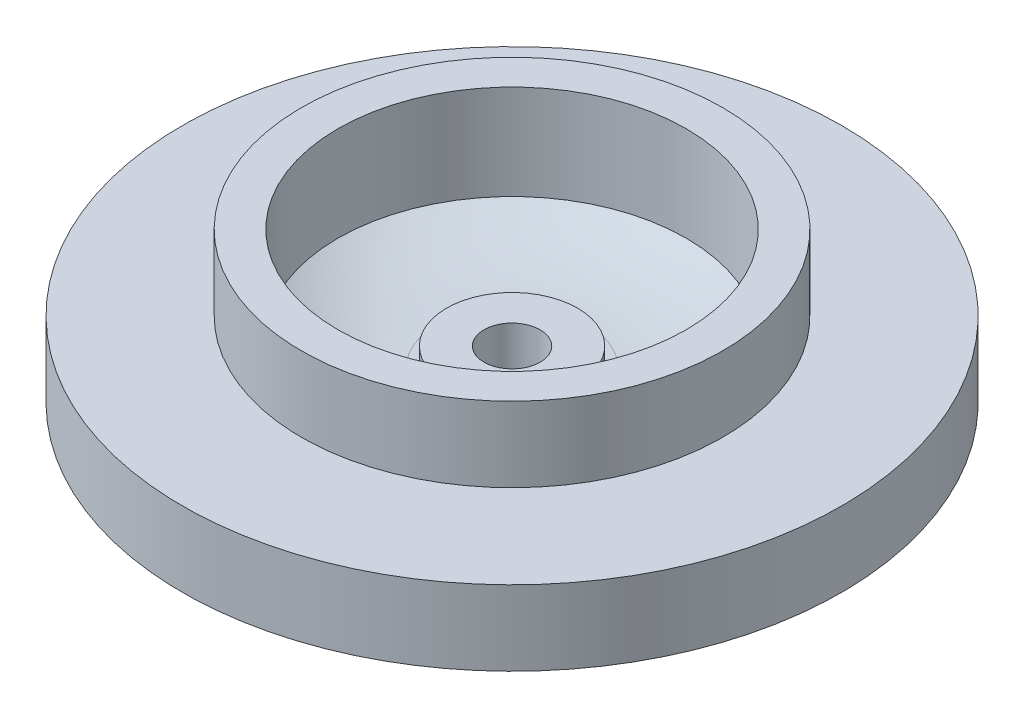
ISO-10303-21;
HEADER;
FILE_DESCRIPTION(('STEP AP214'),'2;1');
FILE_NAME('part.step','',(''),(''),'','','');
FILE_SCHEMA(('AUTOMOTIVE_DESIGN { 1 0 10303 214 1 1 1 1 }'));
ENDSEC;
DATA;
#1=APPLICATION_CONTEXT('core data for automotive mechanical design processes');
#2=APPLICATION_PROTOCOL_DEFINITION('international standard','automotive_design',2000,#1);
#3=PRODUCT_CONTEXT('',#1,'mechanical');
#4=PRODUCT('Part','Part','',(#3));
#5=PRODUCT_RELATED_PRODUCT_CATEGORY('part','',(#4));
#6=PRODUCT_DEFINITION_FORMATION('','',#4);
#7=PRODUCT_DEFINITION_CONTEXT('part definition',#1,'design');
#8=PRODUCT_DEFINITION('design','',#6,#7);
#9=PRODUCT_DEFINITION_SHAPE('','',#8);
#10=(LENGTH_UNIT() NAMED_UNIT(*) SI_UNIT(.MILLI.,.METRE.));
#11=(NAMED_UNIT(*) PLANE_ANGLE_UNIT() SI_UNIT($,.RADIAN.));
#12=(NAMED_UNIT(*) SI_UNIT($,.STERADIAN.) SOLID_ANGLE_UNIT());
#13=UNCERTAINTY_MEASURE_WITH_UNIT(LENGTH_MEASURE(1.E-05),#10,'distance_accuracy_value','');
#14=(GEOMETRIC_REPRESENTATION_CONTEXT(3) GLOBAL_UNCERTAINTY_ASSIGNED_CONTEXT((#13)) GLOBAL_UNIT_ASSIGNED_CONTEXT((#10,
#11,#12)) REPRESENTATION_CONTEXT('',''));
#15=CARTESIAN_POINT('',(0.,0.,0.));
#16=DIRECTION('',(0.,0.,1.));
#17=DIRECTION('',(1.,0.,0.));
#18=AXIS2_PLACEMENT_3D('',#15,#16,#17);
#19=CARTESIAN_POINT('',(-17.6,1.5,0.));
#20=DIRECTION('',(0.,1.,0.));
#21=DIRECTION('',(0.,0.,1.));
#22=AXIS2_PLACEMENT_3D('',#19,#20,#21);
#23=PLANE('',#22);
#24=CARTESIAN_POINT('',(0.,1.5,0.));
#25=DIRECTION('',(0.,-1.,0.));
#26=DIRECTION('',(0.,0.,-1.));
#27=AXIS2_PLACEMENT_3D('',#24,#25,#26);
#28=CIRCLE('',#27,16.6);
#29=CARTESIAN_POINT('',(0.,1.5,-16.6));
#30=VERTEX_POINT('',#29);
#31=EDGE_CURVE('E89',#30,#30,#28,.T.);
#32=ORIENTED_EDGE('',*,*,#31,.F.);
#33=EDGE_LOOP('',(#32));
#34=FACE_BOUND('',#33,.T.);
#35=CARTESIAN_POINT('',(0.,1.5,0.));
#36=DIRECTION('',(0.,-1.,0.));
#37=DIRECTION('',(0.,0.,-1.));
#38=AXIS2_PLACEMENT_3D('',#35,#36,#37);
#39=CIRCLE('',#38,17.6);
#40=CARTESIAN_POINT('',(0.,1.5,-17.6));
#41=VERTEX_POINT('',#40);
#42=EDGE_CURVE('E10',#41,#41,#39,.T.);
#43=ORIENTED_EDGE('',*,*,#42,.T.);
#44=EDGE_LOOP('',(#43));
#45=FACE_BOUND('',#44,.T.);
#46=ADVANCED_FACE('F34',(#34,#45),#23,.F.);
#47=CARTESIAN_POINT('',(0.,0.,0.));
#48=DIRECTION('',(0.,-1.,0.));
#49=DIRECTION('',(0.,0.,-1.));
#50=AXIS2_PLACEMENT_3D('',#47,#48,#49);
#51=CYLINDRICAL_SURFACE('',#50,17.6);
#52=ORIENTED_EDGE('',*,*,#42,.F.);
#53=EDGE_LOOP('',(#52));
#54=FACE_BOUND('',#53,.T.);
#55=CARTESIAN_POINT('',(0.,5.5,0.));
#56=DIRECTION('',(0.,-1.,0.));
#57=DIRECTION('',(0.,0.,-1.));
#58=AXIS2_PLACEMENT_3D('',#55,#56,#57);
#59=CIRCLE('',#58,17.6);
#60=CARTESIAN_POINT('',(0.,5.5,-17.6));
#61=VERTEX_POINT('',#60);
#62=EDGE_CURVE('E41',#61,#61,#59,.T.);
#63=ORIENTED_EDGE('',*,*,#62,.T.);
#64=EDGE_LOOP('',(#63));
#65=FACE_BOUND('',#64,.T.);
#66=ADVANCED_FACE('F113',(#54,#65),#51,.T.);
#67=CARTESIAN_POINT('',(-17.6,5.5,0.));
#68=DIRECTION('',(0.,-1.,0.));
#69=DIRECTION('',(0.,0.,-1.));
#70=AXIS2_PLACEMENT_3D('',#67,#68,#69);
#71=PLANE('',#70);
#72=ORIENTED_EDGE('',*,*,#62,.F.);
#73=EDGE_LOOP('',(#72));
#74=FACE_BOUND('',#73,.T.);
#75=CARTESIAN_POINT('',(0.,5.5,0.));
#76=DIRECTION('',(0.,-1.,0.));
#77=DIRECTION('',(0.,0.,-1.));
#78=AXIS2_PLACEMENT_3D('',#75,#76,#77);
#79=CIRCLE('',#78,11.25);
#80=CARTESIAN_POINT('',(0.,5.5,-11.25));
#81=VERTEX_POINT('',#80);
#82=EDGE_CURVE('E45',#81,#81,#79,.T.);
#83=ORIENTED_EDGE('',*,*,#82,.T.);
#84=EDGE_LOOP('',(#83));
#85=FACE_BOUND('',#84,.T.);
#86=ADVANCED_FACE('F118',(#74,#85),#71,.F.);
#87=CARTESIAN_POINT('',(0.,0.,0.));
#88=DIRECTION('',(0.,-1.,0.));
#89=DIRECTION('',(0.,0.,-1.));
#90=AXIS2_PLACEMENT_3D('',#87,#88,#89);
#91=CYLINDRICAL_SURFACE('',#90,11.25);
#92=ORIENTED_EDGE('',*,*,#82,.F.);
#93=EDGE_LOOP('',(#92));
#94=FACE_BOUND('',#93,.T.);
#95=CARTESIAN_POINT('',(0.,9.5,0.));
#96=DIRECTION('',(0.,-1.,0.));
#97=DIRECTION('',(0.,0.,-1.));
#98=AXIS2_PLACEMENT_3D('',#95,#96,#97);
#99=CIRCLE('',#98,11.25);
#100=CARTESIAN_POINT('',(0.,9.5,-11.25));
#101=VERTEX_POINT('',#100);
#102=EDGE_CURVE('E50',#101,#101,#99,.T.);
#103=ORIENTED_EDGE('',*,*,#102,.T.);
#104=EDGE_LOOP('',(#103));
#105=FACE_BOUND('',#104,.T.);
#106=ADVANCED_FACE('F125',(#94,#105),#91,.T.);
#107=CARTESIAN_POINT('',(-11.25,9.5,0.));
#108=DIRECTION('',(0.,-1.,0.));
#109=DIRECTION('',(0.,0.,-1.));
#110=AXIS2_PLACEMENT_3D('',#107,#108,#109);
#111=PLANE('',#110);
#112=ORIENTED_EDGE('',*,*,#102,.F.);
#113=EDGE_LOOP('',(#112));
#114=FACE_BOUND('',#113,.T.);
#115=CARTESIAN_POINT('',(0.,9.5,0.));
#116=DIRECTION('',(0.,-1.,0.));
#117=DIRECTION('',(0.,0.,-1.));
#118=AXIS2_PLACEMENT_3D('',#115,#116,#117);
#119=CIRCLE('',#118,9.3);
#120=CARTESIAN_POINT('',(0.,9.5,-9.3));
#121=VERTEX_POINT('',#120);
#122=EDGE_CURVE('E53',#121,#121,#119,.T.);
#123=ORIENTED_EDGE('',*,*,#122,.T.);
#124=EDGE_LOOP('',(#123));
#125=FACE_BOUND('',#124,.T.);
#126=ADVANCED_FACE('F132',(#114,#125),#111,.F.);
#127=CARTESIAN_POINT('',(0.,0.,0.));
#128=DIRECTION('',(0.,-1.,0.));
#129=DIRECTION('',(0.,0.,-1.));
#130=AXIS2_PLACEMENT_3D('',#127,#128,#129);
#131=CYLINDRICAL_SURFACE('',#130,9.3);
#132=ORIENTED_EDGE('',*,*,#122,.F.);
#133=EDGE_LOOP('',(#132));
#134=FACE_BOUND('',#133,.T.);
#135=CARTESIAN_POINT('',(0.,4.43592869683777,0.));
#136=DIRECTION('',(0.,-1.,0.));
#137=DIRECTION('',(0.,0.,-1.));
#138=AXIS2_PLACEMENT_3D('',#135,#136,#137);
#139=CIRCLE('',#138,9.3);
#140=CARTESIAN_POINT('',(0.,4.43592869683777,-9.3));
#141=VERTEX_POINT('',#140);
#142=EDGE_CURVE('E56',#141,#141,#139,.T.);
#143=ORIENTED_EDGE('',*,*,#142,.T.);
#144=EDGE_LOOP('',(#143));
#145=FACE_BOUND('',#144,.T.);
#146=ADVANCED_FACE('F136',(#134,#145),#131,.F.);
#147=CARTESIAN_POINT('',(0.,14.28125,0.));
#148=DIRECTION('',(0.,-1.,0.));
#149=DIRECTION('',(0.,0.,-1.));
#150=AXIS2_PLACEMENT_3D('',#147,#148,#149);
#151=DEGENERATE_TOROIDAL_SURFACE('',#150,4.,11.18125,.T.);
#152=ORIENTED_EDGE('',*,*,#142,.F.);
#153=EDGE_LOOP('',(#152));
#154=FACE_BOUND('',#153,.T.);
#155=CARTESIAN_POINT('',(0.,3.1,0.));
#156=DIRECTION('',(0.,-1.,0.));
#157=DIRECTION('',(0.,0.,-1.));
#158=AXIS2_PLACEMENT_3D('',#155,#156,#157);
#159=CIRCLE('',#158,4.);
#160=CARTESIAN_POINT('',(0.,3.1,-4.));
#161=VERTEX_POINT('',#160);
#162=EDGE_CURVE('E59',#161,#161,#159,.T.);
#163=ORIENTED_EDGE('',*,*,#162,.T.);
#164=EDGE_LOOP('',(#163));
#165=FACE_BOUND('',#164,.T.);
#166=ADVANCED_FACE('F140',(#154,#165),#151,.F.);
#167=CARTESIAN_POINT('',(-4.,3.1,0.));
#168=DIRECTION('',(0.,-1.,0.));
#169=DIRECTION('',(0.,0.,-1.));
#170=AXIS2_PLACEMENT_3D('',#167,#168,#169);
#171=PLANE('',#170);
#172=ORIENTED_EDGE('',*,*,#162,.F.);
#173=EDGE_LOOP('',(#172));
#174=FACE_BOUND('',#173,.T.);
#175=CARTESIAN_POINT('',(0.,3.1,0.));
#176=DIRECTION('',(0.,-1.,0.));
#177=DIRECTION('',(0.,0.,-1.));
#178=AXIS2_PLACEMENT_3D('',#175,#176,#177);
#179=CIRCLE('',#178,3.5);
#180=CARTESIAN_POINT('',(0.,3.1,-3.5));
#181=VERTEX_POINT('',#180);
#182=EDGE_CURVE('E62',#181,#181,#179,.T.);
#183=ORIENTED_EDGE('',*,*,#182,.T.);
#184=EDGE_LOOP('',(#183));
#185=FACE_BOUND('',#184,.T.);
#186=ADVANCED_FACE('F144',(#174,#185),#171,.F.);
#187=CARTESIAN_POINT('',(0.,0.,0.));
#188=DIRECTION('',(0.,-1.,0.));
#189=DIRECTION('',(0.,0.,-1.));
#190=AXIS2_PLACEMENT_3D('',#187,#188,#189);
#191=CYLINDRICAL_SURFACE('',#190,3.5);
#192=ORIENTED_EDGE('',*,*,#182,.F.);
#193=EDGE_LOOP('',(#192));
#194=FACE_BOUND('',#193,.T.);
#195=CARTESIAN_POINT('',(0.,4.1,0.));
#196=DIRECTION('',(0.,-1.,0.));
#197=DIRECTION('',(0.,0.,-1.));
#198=AXIS2_PLACEMENT_3D('',#195,#196,#197);
#199=CIRCLE('',#198,3.5);
#200=CARTESIAN_POINT('',(0.,4.1,-3.5));
#201=VERTEX_POINT('',#200);
#202=EDGE_CURVE('E65',#201,#201,#199,.T.);
#203=ORIENTED_EDGE('',*,*,#202,.T.);
#204=EDGE_LOOP('',(#203));
#205=FACE_BOUND('',#204,.T.);
#206=ADVANCED_FACE('F148',(#194,#205),#191,.T.);
#207=CARTESIAN_POINT('',(-3.5,4.1,0.));
#208=DIRECTION('',(0.,-1.,0.));
#209=DIRECTION('',(0.,0.,-1.));
#210=AXIS2_PLACEMENT_3D('',#207,#208,#209);
#211=PLANE('',#210);
#212=CARTESIAN_POINT('',(0.,4.1,0.));
#213=DIRECTION('',(0.,1.,0.));
#214=DIRECTION('',(0.,0.,1.));
#215=AXIS2_PLACEMENT_3D('',#212,#213,#214);
#216=CIRCLE('',#215,1.5);
#217=CARTESIAN_POINT('',(0.,4.1,1.5));
#218=VERTEX_POINT('',#217);
#219=EDGE_CURVE('E92',#218,#218,#216,.T.);
#220=ORIENTED_EDGE('',*,*,#219,.F.);
#221=EDGE_LOOP('',(#220));
#222=FACE_BOUND('',#221,.T.);
#223=ORIENTED_EDGE('',*,*,#202,.F.);
#224=EDGE_LOOP('',(#223));
#225=FACE_BOUND('',#224,.T.);
#226=ADVANCED_FACE('F152',(#222,#225),#211,.F.);
#227=CARTESIAN_POINT('',(-4.,0.,0.));
#228=DIRECTION('',(0.,1.,0.));
#229=DIRECTION('',(0.,0.,1.));
#230=AXIS2_PLACEMENT_3D('',#227,#228,#229);
#231=PLANE('',#230);
#232=CARTESIAN_POINT('',(0.,0.,0.));
#233=DIRECTION('',(0.,1.,0.));
#234=DIRECTION('',(0.,0.,1.));
#235=AXIS2_PLACEMENT_3D('',#232,#233,#234);
#236=CIRCLE('',#235,1.5);
#237=CARTESIAN_POINT('',(0.,0.,1.5));
#238=VERTEX_POINT('',#237);
#239=EDGE_CURVE('E37',#238,#238,#236,.T.);
#240=ORIENTED_EDGE('',*,*,#239,.T.);
#241=EDGE_LOOP('',(#240));
#242=FACE_BOUND('',#241,.T.);
#243=CARTESIAN_POINT('',(0.,0.,0.));
#244=DIRECTION('',(0.,-1.,0.));
#245=DIRECTION('',(0.,0.,-1.));
#246=AXIS2_PLACEMENT_3D('',#243,#244,#245);
#247=CIRCLE('',#246,4.);
#248=CARTESIAN_POINT('',(0.,0.,-4.));
#249=VERTEX_POINT('',#248);
#250=EDGE_CURVE('E68',#249,#249,#247,.T.);
#251=ORIENTED_EDGE('',*,*,#250,.T.);
#252=EDGE_LOOP('',(#251));
#253=FACE_BOUND('',#252,.T.);
#254=ADVANCED_FACE('F99',(#242,#253),#231,.F.);
#255=CARTESIAN_POINT('',(0.,0.,0.));
#256=DIRECTION('',(0.,-1.,0.));
#257=DIRECTION('',(0.,0.,-1.));
#258=AXIS2_PLACEMENT_3D('',#255,#256,#257);
#259=CYLINDRICAL_SURFACE('',#258,4.);
#260=ORIENTED_EDGE('',*,*,#250,.F.);
#261=EDGE_LOOP('',(#260));
#262=FACE_BOUND('',#261,.T.);
#263=CARTESIAN_POINT('',(0.,2.5,0.));
#264=DIRECTION('',(0.,-1.,0.));
#265=DIRECTION('',(0.,0.,-1.));
#266=AXIS2_PLACEMENT_3D('',#263,#264,#265);
#267=CIRCLE('',#266,4.);
#268=CARTESIAN_POINT('',(0.,2.5,-4.));
#269=VERTEX_POINT('',#268);
#270=EDGE_CURVE('E71',#269,#269,#267,.T.);
#271=ORIENTED_EDGE('',*,*,#270,.T.);
#272=EDGE_LOOP('',(#271));
#273=FACE_BOUND('',#272,.T.);
#274=ADVANCED_FACE('F159',(#262,#273),#259,.T.);
#275=CARTESIAN_POINT('',(0.,14.28125,0.));
#276=DIRECTION('',(0.,-1.,0.));
#277=DIRECTION('',(0.,0.,-1.));
#278=AXIS2_PLACEMENT_3D('',#275,#276,#277);
#279=DEGENERATE_TOROIDAL_SURFACE('',#278,4.,11.78125,.T.);
#280=ORIENTED_EDGE('',*,*,#270,.F.);
#281=EDGE_LOOP('',(#280));
#282=FACE_BOUND('',#281,.T.);
#283=CARTESIAN_POINT('',(0.,3.5,0.));
#284=DIRECTION('',(0.,-1.,0.));
#285=DIRECTION('',(0.,0.,-1.));
#286=AXIS2_PLACEMENT_3D('',#283,#284,#285);
#287=CIRCLE('',#286,8.75);
#288=CARTESIAN_POINT('',(0.,3.5,-8.75));
#289=VERTEX_POINT('',#288);
#290=EDGE_CURVE('E74',#289,#289,#287,.T.);
#291=ORIENTED_EDGE('',*,*,#290,.T.);
#292=EDGE_LOOP('',(#291));
#293=FACE_BOUND('',#292,.T.);
#294=ADVANCED_FACE('F162',(#282,#293),#279,.T.);
#295=CARTESIAN_POINT('',(0.,0.,0.));
#296=DIRECTION('',(0.,-1.,0.));
#297=DIRECTION('',(0.,0.,-1.));
#298=AXIS2_PLACEMENT_3D('',#295,#296,#297);
#299=CYLINDRICAL_SURFACE('',#298,8.75);
#300=ORIENTED_EDGE('',*,*,#290,.F.);
#301=EDGE_LOOP('',(#300));
#302=FACE_BOUND('',#301,.T.);
#303=CARTESIAN_POINT('',(0.,0.,0.));
#304=DIRECTION('',(0.,-1.,0.));
#305=DIRECTION('',(0.,0.,-1.));
#306=AXIS2_PLACEMENT_3D('',#303,#304,#305);
#307=CIRCLE('',#306,8.75);
#308=CARTESIAN_POINT('',(0.,0.,-8.75));
#309=VERTEX_POINT('',#308);
#310=EDGE_CURVE('E77',#309,#309,#307,.T.);
#311=ORIENTED_EDGE('',*,*,#310,.T.);
#312=EDGE_LOOP('',(#311));
#313=FACE_BOUND('',#312,.T.);
#314=ADVANCED_FACE('F166',(#302,#313),#299,.F.);
#315=CARTESIAN_POINT('',(-13.5,0.,0.));
#316=DIRECTION('',(0.,1.,0.));
#317=DIRECTION('',(0.,0.,1.));
#318=AXIS2_PLACEMENT_3D('',#315,#316,#317);
#319=PLANE('',#318);
#320=ORIENTED_EDGE('',*,*,#310,.F.);
#321=EDGE_LOOP('',(#320));
#322=FACE_BOUND('',#321,.T.);
#323=CARTESIAN_POINT('',(0.,0.,0.));
#324=DIRECTION('',(0.,-1.,0.));
#325=DIRECTION('',(0.,0.,-1.));
#326=AXIS2_PLACEMENT_3D('',#323,#324,#325);
#327=CIRCLE('',#326,13.5);
#328=CARTESIAN_POINT('',(0.,0.,-13.5));
#329=VERTEX_POINT('',#328);
#330=EDGE_CURVE('E80',#329,#329,#327,.T.);
#331=ORIENTED_EDGE('',*,*,#330,.T.);
#332=EDGE_LOOP('',(#331));
#333=FACE_BOUND('',#332,.T.);
#334=ADVANCED_FACE('F170',(#322,#333),#319,.F.);
#335=CARTESIAN_POINT('',(0.,0.,0.));
#336=DIRECTION('',(0.,-1.,0.));
#337=DIRECTION('',(0.,0.,-1.));
#338=AXIS2_PLACEMENT_3D('',#335,#336,#337);
#339=CYLINDRICAL_SURFACE('',#338,13.5);
#340=ORIENTED_EDGE('',*,*,#330,.F.);
#341=EDGE_LOOP('',(#340));
#342=FACE_BOUND('',#341,.T.);
#343=CARTESIAN_POINT('',(0.,3.,0.));
#344=DIRECTION('',(0.,-1.,0.));
#345=DIRECTION('',(0.,0.,-1.));
#346=AXIS2_PLACEMENT_3D('',#343,#344,#345);
#347=CIRCLE('',#346,13.5);
#348=CARTESIAN_POINT('',(0.,3.,-13.5));
#349=VERTEX_POINT('',#348);
#350=EDGE_CURVE('E83',#349,#349,#347,.T.);
#351=ORIENTED_EDGE('',*,*,#350,.T.);
#352=EDGE_LOOP('',(#351));
#353=FACE_BOUND('',#352,.T.);
#354=ADVANCED_FACE('F174',(#342,#353),#339,.T.);
#355=CARTESIAN_POINT('',(-16.6,3.,0.));
#356=DIRECTION('',(0.,1.,0.));
#357=DIRECTION('',(0.,0.,1.));
#358=AXIS2_PLACEMENT_3D('',#355,#356,#357);
#359=PLANE('',#358);
#360=ORIENTED_EDGE('',*,*,#350,.F.);
#361=EDGE_LOOP('',(#360));
#362=FACE_BOUND('',#361,.T.);
#363=CARTESIAN_POINT('',(0.,3.,0.));
#364=DIRECTION('',(0.,-1.,0.));
#365=DIRECTION('',(0.,0.,-1.));
#366=AXIS2_PLACEMENT_3D('',#363,#364,#365);
#367=CIRCLE('',#366,16.6);
#368=CARTESIAN_POINT('',(0.,3.,-16.6));
#369=VERTEX_POINT('',#368);
#370=EDGE_CURVE('E86',#369,#369,#367,.T.);
#371=ORIENTED_EDGE('',*,*,#370,.T.);
#372=EDGE_LOOP('',(#371));
#373=FACE_BOUND('',#372,.T.);
#374=ADVANCED_FACE('F109',(#362,#373),#359,.F.);
#375=CARTESIAN_POINT('',(0.,0.,0.));
#376=DIRECTION('',(0.,-1.,0.));
#377=DIRECTION('',(0.,0.,-1.));
#378=AXIS2_PLACEMENT_3D('',#375,#376,#377);
#379=CYLINDRICAL_SURFACE('',#378,16.6);
#380=ORIENTED_EDGE('',*,*,#370,.F.);
#381=EDGE_LOOP('',(#380));
#382=FACE_BOUND('',#381,.T.);
#383=ORIENTED_EDGE('',*,*,#31,.T.);
#384=EDGE_LOOP('',(#383));
#385=FACE_BOUND('',#384,.T.);
#386=ADVANCED_FACE('F104',(#382,#385),#379,.F.);
#387=CARTESIAN_POINT('',(0.,-5.9,0.));
#388=DIRECTION('',(0.,1.,0.));
#389=DIRECTION('',(0.,0.,1.));
#390=AXIS2_PLACEMENT_3D('',#387,#388,#389);
#391=CYLINDRICAL_SURFACE('',#390,1.5);
#392=ORIENTED_EDGE('',*,*,#219,.T.);
#393=EDGE_LOOP('',(#392));
#394=FACE_BOUND('',#393,.T.);
#395=ORIENTED_EDGE('',*,*,#239,.F.);
#396=EDGE_LOOP('',(#395));
#397=FACE_BOUND('',#396,.T.);
#398=ADVANCED_FACE('F102',(#394,#397),#391,.F.);
#399=CLOSED_SHELL('',(#46,#66,#86,#106,#126,#146,#166,#186,#206,#226,#254,#274,#294,#314,#334,
#354,#374,#386,#398));
#400=MANIFOLD_SOLID_BREP('B2',#399);
#401=ADVANCED_BREP_SHAPE_REPRESENTATION('',(#18,#400),#14);
#402=SHAPE_DEFINITION_REPRESENTATION(#9,#401);
ENDSEC;
END-ISO-10303-21;
